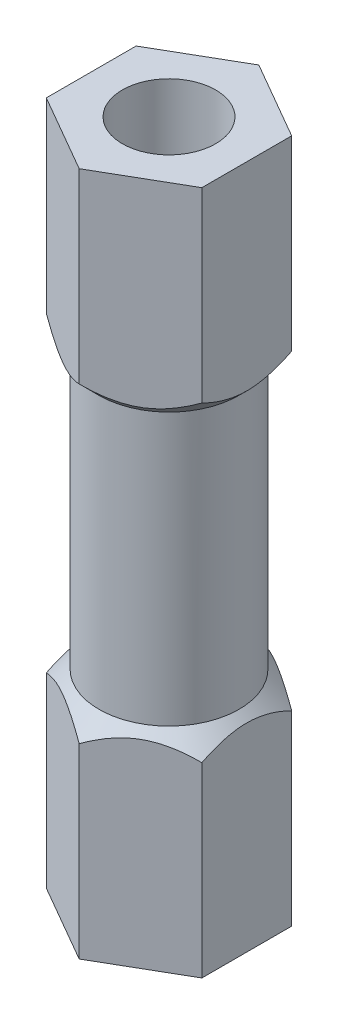
ISO-10303-21;
HEADER;
FILE_DESCRIPTION(('STEP AP214'),'2;1');
FILE_NAME('part.step','',(''),(''),'','','');
FILE_SCHEMA(('AUTOMOTIVE_DESIGN { 1 0 10303 214 1 1 1 1 }'));
ENDSEC;
DATA;
#1=APPLICATION_CONTEXT('core data for automotive mechanical design processes');
#2=APPLICATION_PROTOCOL_DEFINITION('international standard','automotive_design',2000,#1);
#3=PRODUCT_CONTEXT('',#1,'mechanical');
#4=PRODUCT('Part','Part','',(#3));
#5=PRODUCT_RELATED_PRODUCT_CATEGORY('part','',(#4));
#6=PRODUCT_DEFINITION_FORMATION('','',#4);
#7=PRODUCT_DEFINITION_CONTEXT('part definition',#1,'design');
#8=PRODUCT_DEFINITION('design','',#6,#7);
#9=PRODUCT_DEFINITION_SHAPE('','',#8);
#10=(LENGTH_UNIT() NAMED_UNIT(*) SI_UNIT(.MILLI.,.METRE.));
#11=(NAMED_UNIT(*) PLANE_ANGLE_UNIT() SI_UNIT($,.RADIAN.));
#12=(NAMED_UNIT(*) SI_UNIT($,.STERADIAN.) SOLID_ANGLE_UNIT());
#13=UNCERTAINTY_MEASURE_WITH_UNIT(LENGTH_MEASURE(1.E-05),#10,'distance_accuracy_value','');
#14=(GEOMETRIC_REPRESENTATION_CONTEXT(3) GLOBAL_UNCERTAINTY_ASSIGNED_CONTEXT((#13)) GLOBAL_UNIT_ASSIGNED_CONTEXT((#10,
#11,#12)) REPRESENTATION_CONTEXT('',''));
#15=CARTESIAN_POINT('',(0.,0.,0.));
#16=DIRECTION('',(0.,0.,1.));
#17=DIRECTION('',(1.,0.,0.));
#18=AXIS2_PLACEMENT_3D('',#15,#16,#17);
#19=CARTESIAN_POINT('',(0.,11.,0.));
#20=DIRECTION('',(0.,1.,0.));
#21=DIRECTION('',(0.,0.,1.));
#22=AXIS2_PLACEMENT_3D('',#19,#20,#21);
#23=PLANE('',#22);
#24=DIRECTION('',(0.866025403784439,0.,0.5));
#25=VECTOR('',#24,1.);
#26=CARTESIAN_POINT('',(-2.5,11.,1.44337567297406));
#27=LINE('',#26,#25);
#28=CARTESIAN_POINT('',(-2.5,11.,1.44337567297406));
#29=VERTEX_POINT('',#28);
#30=CARTESIAN_POINT('',(0.,11.,2.88675134594813));
#31=VERTEX_POINT('',#30);
#32=EDGE_CURVE('E9',#29,#31,#27,.T.);
#33=ORIENTED_EDGE('',*,*,#32,.T.);
#34=DIRECTION('',(0.866025403784439,0.,-0.5));
#35=VECTOR('',#34,1.);
#36=CARTESIAN_POINT('',(0.,11.,2.88675134594813));
#37=LINE('',#36,#35);
#38=CARTESIAN_POINT('',(2.5,11.,1.44337567297406));
#39=VERTEX_POINT('',#38);
#40=EDGE_CURVE('E470',#31,#39,#37,.T.);
#41=ORIENTED_EDGE('',*,*,#40,.T.);
#42=DIRECTION('',(0.,0.,-1.));
#43=VECTOR('',#42,1.);
#44=CARTESIAN_POINT('',(2.5,11.,1.44337567297406));
#45=LINE('',#44,#43);
#46=CARTESIAN_POINT('',(2.5,11.,-1.44337567297406));
#47=VERTEX_POINT('',#46);
#48=EDGE_CURVE('E344',#39,#47,#45,.T.);
#49=ORIENTED_EDGE('',*,*,#48,.T.);
#50=DIRECTION('',(-0.866025403784439,0.,-0.5));
#51=VECTOR('',#50,1.);
#52=CARTESIAN_POINT('',(2.5,11.,-1.44337567297406));
#53=LINE('',#52,#51);
#54=CARTESIAN_POINT('',(0.,11.,-2.88675134594813));
#55=VERTEX_POINT('',#54);
#56=EDGE_CURVE('E490',#47,#55,#53,.T.);
#57=ORIENTED_EDGE('',*,*,#56,.T.);
#58=DIRECTION('',(-0.866025403784438,0.,0.5));
#59=VECTOR('',#58,1.);
#60=CARTESIAN_POINT('',(0.,11.,-2.88675134594813));
#61=LINE('',#60,#59);
#62=CARTESIAN_POINT('',(-2.5,11.,-1.44337567297406));
#63=VERTEX_POINT('',#62);
#64=EDGE_CURVE('E248',#55,#63,#61,.T.);
#65=ORIENTED_EDGE('',*,*,#64,.T.);
#66=DIRECTION('',(0.,0.,1.));
#67=VECTOR('',#66,1.);
#68=CARTESIAN_POINT('',(-2.5,11.,-1.44337567297406));
#69=LINE('',#68,#67);
#70=EDGE_CURVE('E324',#63,#29,#69,.T.);
#71=ORIENTED_EDGE('',*,*,#70,.T.);
#72=EDGE_LOOP('',(#33,#41,#49,#57,#65,#71));
#73=FACE_BOUND('',#72,.T.);
#74=CARTESIAN_POINT('',(0.,11.,0.));
#75=DIRECTION('',(0.,-1.,0.));
#76=DIRECTION('',(1.,0.,0.));
#77=AXIS2_PLACEMENT_3D('',#74,#75,#76);
#78=CIRCLE('',#77,1.5);
#79=CARTESIAN_POINT('',(1.5,11.,0.));
#80=VERTEX_POINT('',#79);
#81=EDGE_CURVE('E323',#80,#80,#78,.T.);
#82=ORIENTED_EDGE('',*,*,#81,.T.);
#83=EDGE_LOOP('',(#82));
#84=FACE_BOUND('',#83,.T.);
#85=ADVANCED_FACE('F14',(#73,#84),#23,.T.);
#86=CARTESIAN_POINT('',(-2.5,5.,1.44337567297406));
#87=DIRECTION('',(-0.5,0.,0.866025403784439));
#88=DIRECTION('',(0.866025403784439,0.,0.5));
#89=AXIS2_PLACEMENT_3D('',#86,#87,#88);
#90=PLANE('',#89);
#91=DIRECTION('',(0.866025403784439,0.,0.5));
#92=VECTOR('',#91,1.);
#93=CARTESIAN_POINT('',(-2.5,5.,1.44337567297406));
#94=LINE('',#93,#92);
#95=CARTESIAN_POINT('',(-2.5,5.,1.44337567297406));
#96=VERTEX_POINT('',#95);
#97=CARTESIAN_POINT('',(-2.48826491511308,5.,1.45015092739249));
#98=VERTEX_POINT('',#97);
#99=EDGE_CURVE('E385',#96,#98,#94,.T.);
#100=ORIENTED_EDGE('',*,*,#99,.T.);
#101=CARTESIAN_POINT('',(-4.10783134561856,6.26,0.515093812769667));
#102=CARTESIAN_POINT('',(-1.25,3.62966183574879,2.1650635094611));
#103=CARTESIAN_POINT('',(1.60783134561857,6.26,3.81503320615252));
#104=(BOUNDED_CURVE() B_SPLINE_CURVE(2,(#101,#102,#103),.UNSPECIFIED.,.F.,
.F.) B_SPLINE_CURVE_WITH_KNOTS((3,3),(-0.736999321573637,0.),
.UNSPECIFIED.) CURVE() GEOMETRIC_REPRESENTATION_ITEM() RATIONAL_B_SPLINE_CURVE((1.,1.656,1.)) REPRESENTATION_ITEM(''));
#105=CARTESIAN_POINT('',(-0.0117350848869151,5.,2.8799760915297));
#106=VERTEX_POINT('',#105);
#107=EDGE_CURVE('E418',#98,#106,#104,.T.);
#108=ORIENTED_EDGE('',*,*,#107,.T.);
#109=DIRECTION('',(0.866025403784439,0.,0.5));
#110=VECTOR('',#109,1.);
#111=CARTESIAN_POINT('',(-2.5,5.,1.44337567297406));
#112=LINE('',#111,#110);
#113=CARTESIAN_POINT('',(0.,5.,2.88675134594813));
#114=VERTEX_POINT('',#113);
#115=EDGE_CURVE('E399',#106,#114,#112,.T.);
#116=ORIENTED_EDGE('',*,*,#115,.T.);
#117=DIRECTION('',(0.,1.,0.));
#118=VECTOR('',#117,1.);
#119=CARTESIAN_POINT('',(0.,5.,2.88675134594813));
#120=LINE('',#119,#118);
#121=EDGE_CURVE('E27',#114,#31,#120,.T.);
#122=ORIENTED_EDGE('',*,*,#121,.T.);
#123=ORIENTED_EDGE('',*,*,#32,.F.);
#124=DIRECTION('',(0.,1.,0.));
#125=VECTOR('',#124,1.);
#126=CARTESIAN_POINT('',(-2.5,5.,1.44337567297406));
#127=LINE('',#126,#125);
#128=EDGE_CURVE('E327',#96,#29,#127,.T.);
#129=ORIENTED_EDGE('',*,*,#128,.F.);
#130=EDGE_LOOP('',(#100,#108,#116,#122,#123,#129));
#131=FACE_BOUND('',#130,.T.);
#132=ADVANCED_FACE('F551',(#131),#90,.T.);
#133=CARTESIAN_POINT('',(0.,5.,2.88675134594813));
#134=DIRECTION('',(0.5,0.,0.866025403784439));
#135=DIRECTION('',(0.866025403784439,0.,-0.5));
#136=AXIS2_PLACEMENT_3D('',#133,#134,#135);
#137=PLANE('',#136);
#138=DIRECTION('',(0.866025403784439,0.,-0.5));
#139=VECTOR('',#138,1.);
#140=CARTESIAN_POINT('',(0.,5.,2.88675134594813));
#141=LINE('',#140,#139);
#142=CARTESIAN_POINT('',(0.011735084886926,5.,2.8799760915297));
#143=VERTEX_POINT('',#142);
#144=EDGE_CURVE('E381',#114,#143,#141,.T.);
#145=ORIENTED_EDGE('',*,*,#144,.T.);
#146=CARTESIAN_POINT('',(-1.60783134561856,6.26,3.81503320615252));
#147=CARTESIAN_POINT('',(1.25,3.62966183574879,2.16506350946109));
#148=CARTESIAN_POINT('',(4.10783134561856,6.26,0.51509381276967));
#149=(BOUNDED_CURVE() B_SPLINE_CURVE(2,(#146,#147,#148),.UNSPECIFIED.,.F.,
.F.) B_SPLINE_CURVE_WITH_KNOTS((3,3),(-0.736999321573636,0.),
.UNSPECIFIED.) CURVE() GEOMETRIC_REPRESENTATION_ITEM() RATIONAL_B_SPLINE_CURVE((1.,1.656,1.)) REPRESENTATION_ITEM(''));
#150=CARTESIAN_POINT('',(2.48826491511308,5.,1.45015092739249));
#151=VERTEX_POINT('',#150);
#152=EDGE_CURVE('E356',#143,#151,#149,.T.);
#153=ORIENTED_EDGE('',*,*,#152,.T.);
#154=DIRECTION('',(0.866025403784439,0.,-0.5));
#155=VECTOR('',#154,1.);
#156=CARTESIAN_POINT('',(0.,5.,2.88675134594813));
#157=LINE('',#156,#155);
#158=CARTESIAN_POINT('',(2.5,5.,1.44337567297406));
#159=VERTEX_POINT('',#158);
#160=EDGE_CURVE('E349',#151,#159,#157,.T.);
#161=ORIENTED_EDGE('',*,*,#160,.T.);
#162=DIRECTION('',(0.,1.,0.));
#163=VECTOR('',#162,1.);
#164=CARTESIAN_POINT('',(2.5,5.,1.44337567297406));
#165=LINE('',#164,#163);
#166=EDGE_CURVE('E347',#159,#39,#165,.T.);
#167=ORIENTED_EDGE('',*,*,#166,.T.);
#168=ORIENTED_EDGE('',*,*,#40,.F.);
#169=ORIENTED_EDGE('',*,*,#121,.F.);
#170=EDGE_LOOP('',(#145,#153,#161,#167,#168,#169));
#171=FACE_BOUND('',#170,.T.);
#172=ADVANCED_FACE('F562',(#171),#137,.T.);
#173=CARTESIAN_POINT('',(2.5,5.,1.44337567297406));
#174=DIRECTION('',(1.,0.,0.));
#175=DIRECTION('',(0.,0.,-1.));
#176=AXIS2_PLACEMENT_3D('',#173,#174,#175);
#177=PLANE('',#176);
#178=DIRECTION('',(0.,0.,-1.));
#179=VECTOR('',#178,1.);
#180=CARTESIAN_POINT('',(2.5,5.,1.44337567297406));
#181=LINE('',#180,#179);
#182=CARTESIAN_POINT('',(2.5,5.,1.4298251641372));
#183=VERTEX_POINT('',#182);
#184=EDGE_CURVE('E80',#159,#183,#181,.T.);
#185=ORIENTED_EDGE('',*,*,#184,.T.);
#186=CARTESIAN_POINT('',(2.5,6.26,3.29993939338286));
#187=CARTESIAN_POINT('',(2.5,3.62966183574879,0.));
#188=CARTESIAN_POINT('',(2.5,6.26,-3.29993939338286));
#189=(BOUNDED_CURVE() B_SPLINE_CURVE(2,(#186,#187,#188),.UNSPECIFIED.,.F.,
.F.) B_SPLINE_CURVE_WITH_KNOTS((3,3),(-0.736999321573636,0.),
.UNSPECIFIED.) CURVE() GEOMETRIC_REPRESENTATION_ITEM() RATIONAL_B_SPLINE_CURVE((1.,1.656,1.)) REPRESENTATION_ITEM(''));
#190=CARTESIAN_POINT('',(2.5,5.,-1.4298251641372));
#191=VERTEX_POINT('',#190);
#192=EDGE_CURVE('E274',#183,#191,#189,.T.);
#193=ORIENTED_EDGE('',*,*,#192,.T.);
#194=DIRECTION('',(0.,0.,-1.));
#195=VECTOR('',#194,1.);
#196=CARTESIAN_POINT('',(2.5,5.,1.44337567297406));
#197=LINE('',#196,#195);
#198=CARTESIAN_POINT('',(2.5,5.,-1.44337567297406));
#199=VERTEX_POINT('',#198);
#200=EDGE_CURVE('E89',#191,#199,#197,.T.);
#201=ORIENTED_EDGE('',*,*,#200,.T.);
#202=DIRECTION('',(0.,1.,0.));
#203=VECTOR('',#202,1.);
#204=CARTESIAN_POINT('',(2.5,5.,-1.44337567297406));
#205=LINE('',#204,#203);
#206=EDGE_CURVE('E348',#199,#47,#205,.T.);
#207=ORIENTED_EDGE('',*,*,#206,.T.);
#208=ORIENTED_EDGE('',*,*,#48,.F.);
#209=ORIENTED_EDGE('',*,*,#166,.F.);
#210=EDGE_LOOP('',(#185,#193,#201,#207,#208,#209));
#211=FACE_BOUND('',#210,.T.);
#212=ADVANCED_FACE('F555',(#211),#177,.T.);
#213=CARTESIAN_POINT('',(2.5,5.,-1.44337567297406));
#214=DIRECTION('',(0.5,0.,-0.866025403784439));
#215=DIRECTION('',(-0.866025403784439,0.,-0.5));
#216=AXIS2_PLACEMENT_3D('',#213,#214,#215);
#217=PLANE('',#216);
#218=DIRECTION('',(-0.866025403784439,0.,-0.5));
#219=VECTOR('',#218,1.);
#220=CARTESIAN_POINT('',(2.5,5.,-1.44337567297406));
#221=LINE('',#220,#219);
#222=CARTESIAN_POINT('',(2.48826491511307,5.,-1.4501509273925));
#223=VERTEX_POINT('',#222);
#224=EDGE_CURVE('E372',#199,#223,#221,.T.);
#225=ORIENTED_EDGE('',*,*,#224,.T.);
#226=CARTESIAN_POINT('',(4.10783134561856,6.26,-0.515093812769673));
#227=CARTESIAN_POINT('',(1.25,3.62966183574879,-2.1650635094611));
#228=CARTESIAN_POINT('',(-1.60783134561857,6.26,-3.81503320615252));
#229=(BOUNDED_CURVE() B_SPLINE_CURVE(2,(#226,#227,#228),.UNSPECIFIED.,.F.,
.F.) B_SPLINE_CURVE_WITH_KNOTS((3,3),(-0.736999321573636,0.),
.UNSPECIFIED.) CURVE() GEOMETRIC_REPRESENTATION_ITEM() RATIONAL_B_SPLINE_CURVE((1.,1.656,1.)) REPRESENTATION_ITEM(''));
#230=CARTESIAN_POINT('',(0.0117350848869233,5.,-2.8799760915297));
#231=VERTEX_POINT('',#230);
#232=EDGE_CURVE('E266',#223,#231,#229,.T.);
#233=ORIENTED_EDGE('',*,*,#232,.T.);
#234=DIRECTION('',(-0.866025403784439,0.,-0.5));
#235=VECTOR('',#234,1.);
#236=CARTESIAN_POINT('',(2.5,5.,-1.44337567297406));
#237=LINE('',#236,#235);
#238=CARTESIAN_POINT('',(0.,5.,-2.88675134594813));
#239=VERTEX_POINT('',#238);
#240=EDGE_CURVE('E239',#231,#239,#237,.T.);
#241=ORIENTED_EDGE('',*,*,#240,.T.);
#242=DIRECTION('',(0.,1.,0.));
#243=VECTOR('',#242,1.);
#244=CARTESIAN_POINT('',(0.,5.,-2.88675134594813));
#245=LINE('',#244,#243);
#246=EDGE_CURVE('E254',#239,#55,#245,.T.);
#247=ORIENTED_EDGE('',*,*,#246,.T.);
#248=ORIENTED_EDGE('',*,*,#56,.F.);
#249=ORIENTED_EDGE('',*,*,#206,.F.);
#250=EDGE_LOOP('',(#225,#233,#241,#247,#248,#249));
#251=FACE_BOUND('',#250,.T.);
#252=ADVANCED_FACE('F447',(#251),#217,.T.);
#253=CARTESIAN_POINT('',(0.,5.,-2.88675134594813));
#254=DIRECTION('',(-0.5,0.,-0.866025403784438));
#255=DIRECTION('',(-0.866025403784438,0.,0.5));
#256=AXIS2_PLACEMENT_3D('',#253,#254,#255);
#257=PLANE('',#256);
#258=DIRECTION('',(-0.866025403784438,0.,0.5));
#259=VECTOR('',#258,1.);
#260=CARTESIAN_POINT('',(0.,5.,-2.88675134594813));
#261=LINE('',#260,#259);
#262=CARTESIAN_POINT('',(-0.0117350848869184,5.,-2.8799760915297));
#263=VERTEX_POINT('',#262);
#264=EDGE_CURVE('E292',#239,#263,#261,.T.);
#265=ORIENTED_EDGE('',*,*,#264,.T.);
#266=CARTESIAN_POINT('',(1.60783134561857,6.26,-3.81503320615252));
#267=CARTESIAN_POINT('',(-1.25,3.62966183574879,-2.1650635094611));
#268=CARTESIAN_POINT('',(-4.10783134561856,6.26,-0.515093812769662));
#269=(BOUNDED_CURVE() B_SPLINE_CURVE(2,(#266,#267,#268),.UNSPECIFIED.,.F.,
.F.) B_SPLINE_CURVE_WITH_KNOTS((3,3),(-0.736999321573637,0.),
.UNSPECIFIED.) CURVE() GEOMETRIC_REPRESENTATION_ITEM() RATIONAL_B_SPLINE_CURVE((1.,1.656,1.)) REPRESENTATION_ITEM(''));
#270=CARTESIAN_POINT('',(-2.48826491511308,5.,-1.45015092739248));
#271=VERTEX_POINT('',#270);
#272=EDGE_CURVE('E241',#263,#271,#269,.T.);
#273=ORIENTED_EDGE('',*,*,#272,.T.);
#274=DIRECTION('',(-0.866025403784438,0.,0.5));
#275=VECTOR('',#274,1.);
#276=CARTESIAN_POINT('',(0.,5.,-2.88675134594813));
#277=LINE('',#276,#275);
#278=CARTESIAN_POINT('',(-2.5,5.,-1.44337567297406));
#279=VERTEX_POINT('',#278);
#280=EDGE_CURVE('E288',#271,#279,#277,.T.);
#281=ORIENTED_EDGE('',*,*,#280,.T.);
#282=DIRECTION('',(0.,1.,0.));
#283=VECTOR('',#282,1.);
#284=CARTESIAN_POINT('',(-2.5,5.,-1.44337567297406));
#285=LINE('',#284,#283);
#286=EDGE_CURVE('E255',#279,#63,#285,.T.);
#287=ORIENTED_EDGE('',*,*,#286,.T.);
#288=ORIENTED_EDGE('',*,*,#64,.F.);
#289=ORIENTED_EDGE('',*,*,#246,.F.);
#290=EDGE_LOOP('',(#265,#273,#281,#287,#288,#289));
#291=FACE_BOUND('',#290,.T.);
#292=ADVANCED_FACE('F461',(#291),#257,.T.);
#293=CARTESIAN_POINT('',(-2.5,5.,-1.44337567297406));
#294=DIRECTION('',(-1.,0.,0.));
#295=DIRECTION('',(0.,0.,1.));
#296=AXIS2_PLACEMENT_3D('',#293,#294,#295);
#297=PLANE('',#296);
#298=DIRECTION('',(0.,0.,1.));
#299=VECTOR('',#298,1.);
#300=CARTESIAN_POINT('',(-2.5,5.,-1.44337567297406));
#301=LINE('',#300,#299);
#302=CARTESIAN_POINT('',(-2.5,5.,-1.42982516413722));
#303=VERTEX_POINT('',#302);
#304=EDGE_CURVE('E293',#279,#303,#301,.T.);
#305=ORIENTED_EDGE('',*,*,#304,.T.);
#306=CARTESIAN_POINT('',(-2.5,6.26,-3.29993939338286));
#307=CARTESIAN_POINT('',(-2.5,3.62966183574879,0.));
#308=CARTESIAN_POINT('',(-2.5,6.26,3.29993939338287));
#309=(BOUNDED_CURVE() B_SPLINE_CURVE(2,(#306,#307,#308),.UNSPECIFIED.,.F.,
.F.) B_SPLINE_CURVE_WITH_KNOTS((3,3),(-0.736999321573638,0.),
.UNSPECIFIED.) CURVE() GEOMETRIC_REPRESENTATION_ITEM() RATIONAL_B_SPLINE_CURVE((1.,1.656,1.)) REPRESENTATION_ITEM(''));
#310=CARTESIAN_POINT('',(-2.5,5.,1.42982516413722));
#311=VERTEX_POINT('',#310);
#312=EDGE_CURVE('E417',#303,#311,#309,.T.);
#313=ORIENTED_EDGE('',*,*,#312,.T.);
#314=DIRECTION('',(0.,0.,1.));
#315=VECTOR('',#314,1.);
#316=CARTESIAN_POINT('',(-2.5,5.,-1.44337567297406));
#317=LINE('',#316,#315);
#318=EDGE_CURVE('E374',#311,#96,#317,.T.);
#319=ORIENTED_EDGE('',*,*,#318,.T.);
#320=ORIENTED_EDGE('',*,*,#128,.T.);
#321=ORIENTED_EDGE('',*,*,#70,.F.);
#322=ORIENTED_EDGE('',*,*,#286,.F.);
#323=EDGE_LOOP('',(#305,#313,#319,#320,#321,#322));
#324=FACE_BOUND('',#323,.T.);
#325=ADVANCED_FACE('F546',(#324),#297,.T.);
#326=CARTESIAN_POINT('',(0.,5.,0.));
#327=DIRECTION('',(0.,1.,0.));
#328=DIRECTION('',(0.,0.,1.));
#329=AXIS2_PLACEMENT_3D('',#326,#327,#328);
#330=PLANE('',#329);
#331=CARTESIAN_POINT('',(0.,5.,0.));
#332=DIRECTION('',(0.,-1.,0.));
#333=DIRECTION('',(1.,0.,0.));
#334=AXIS2_PLACEMENT_3D('',#331,#332,#333);
#335=CIRCLE('',#334,2.88);
#336=EDGE_CURVE('E278',#183,#151,#335,.T.);
#337=ORIENTED_EDGE('',*,*,#336,.F.);
#338=ORIENTED_EDGE('',*,*,#184,.F.);
#339=ORIENTED_EDGE('',*,*,#160,.F.);
#340=EDGE_LOOP('',(#337,#338,#339));
#341=FACE_BOUND('',#340,.T.);
#342=ADVANCED_FACE('F560',(#341),#330,.F.);
#343=CARTESIAN_POINT('',(0.,-11.,0.));
#344=DIRECTION('',(0.,-1.,0.));
#345=DIRECTION('',(0.,0.,-1.));
#346=AXIS2_PLACEMENT_3D('',#343,#344,#345);
#347=PLANE('',#346);
#348=DIRECTION('',(0.866025403784438,0.,-0.5));
#349=VECTOR('',#348,1.);
#350=CARTESIAN_POINT('',(-2.5,-11.,-1.44337567297406));
#351=LINE('',#350,#349);
#352=CARTESIAN_POINT('',(-2.5,-11.,-1.44337567297406));
#353=VERTEX_POINT('',#352);
#354=CARTESIAN_POINT('',(0.,-11.,-2.88675134594813));
#355=VERTEX_POINT('',#354);
#356=EDGE_CURVE('E436',#353,#355,#351,.T.);
#357=ORIENTED_EDGE('',*,*,#356,.T.);
#358=DIRECTION('',(0.866025403784439,0.,0.5));
#359=VECTOR('',#358,1.);
#360=CARTESIAN_POINT('',(0.,-11.,-2.88675134594813));
#361=LINE('',#360,#359);
#362=CARTESIAN_POINT('',(2.5,-11.,-1.44337567297406));
#363=VERTEX_POINT('',#362);
#364=EDGE_CURVE('E317',#355,#363,#361,.T.);
#365=ORIENTED_EDGE('',*,*,#364,.T.);
#366=DIRECTION('',(0.,0.,1.));
#367=VECTOR('',#366,1.);
#368=CARTESIAN_POINT('',(2.5,-11.,-1.44337567297406));
#369=LINE('',#368,#367);
#370=CARTESIAN_POINT('',(2.5,-11.,1.44337567297406));
#371=VERTEX_POINT('',#370);
#372=EDGE_CURVE('E318',#363,#371,#369,.T.);
#373=ORIENTED_EDGE('',*,*,#372,.T.);
#374=DIRECTION('',(-0.866025403784439,0.,0.5));
#375=VECTOR('',#374,1.);
#376=CARTESIAN_POINT('',(2.5,-11.,1.44337567297406));
#377=LINE('',#376,#375);
#378=CARTESIAN_POINT('',(0.,-11.,2.88675134594813));
#379=VERTEX_POINT('',#378);
#380=EDGE_CURVE('E343',#371,#379,#377,.T.);
#381=ORIENTED_EDGE('',*,*,#380,.T.);
#382=DIRECTION('',(-0.866025403784439,0.,-0.5));
#383=VECTOR('',#382,1.);
#384=CARTESIAN_POINT('',(0.,-11.,2.88675134594813));
#385=LINE('',#384,#383);
#386=CARTESIAN_POINT('',(-2.5,-11.,1.44337567297406));
#387=VERTEX_POINT('',#386);
#388=EDGE_CURVE('E211',#379,#387,#385,.T.);
#389=ORIENTED_EDGE('',*,*,#388,.T.);
#390=DIRECTION('',(0.,0.,-1.));
#391=VECTOR('',#390,1.);
#392=CARTESIAN_POINT('',(-2.5,-11.,1.44337567297406));
#393=LINE('',#392,#391);
#394=EDGE_CURVE('E209',#387,#353,#393,.T.);
#395=ORIENTED_EDGE('',*,*,#394,.T.);
#396=EDGE_LOOP('',(#357,#365,#373,#381,#389,#395));
#397=FACE_BOUND('',#396,.T.);
#398=CARTESIAN_POINT('',(0.,-11.,0.));
#399=DIRECTION('',(0.,1.,0.));
#400=DIRECTION('',(1.,0.,0.));
#401=AXIS2_PLACEMENT_3D('',#398,#399,#400);
#402=CIRCLE('',#401,1.5);
#403=CARTESIAN_POINT('',(-1.5,-11.,0.));
#404=VERTEX_POINT('',#403);
#405=EDGE_CURVE('E321',#404,#404,#402,.T.);
#406=ORIENTED_EDGE('',*,*,#405,.T.);
#407=EDGE_LOOP('',(#406));
#408=FACE_BOUND('',#407,.T.);
#409=ADVANCED_FACE('F623',(#397,#408),#347,.T.);
#410=CARTESIAN_POINT('',(-2.5,-5.,-1.44337567297406));
#411=DIRECTION('',(-0.5,0.,-0.866025403784438));
#412=DIRECTION('',(0.866025403784438,0.,-0.5));
#413=AXIS2_PLACEMENT_3D('',#410,#411,#412);
#414=PLANE('',#413);
#415=DIRECTION('',(0.866025403784438,0.,-0.5));
#416=VECTOR('',#415,1.);
#417=CARTESIAN_POINT('',(-2.5,-5.,-1.44337567297406));
#418=LINE('',#417,#416);
#419=CARTESIAN_POINT('',(-2.5,-5.,-1.44337567297406));
#420=VERTEX_POINT('',#419);
#421=CARTESIAN_POINT('',(-2.48826491511308,-5.,-1.45015092739248));
#422=VERTEX_POINT('',#421);
#423=EDGE_CURVE('E280',#420,#422,#418,.T.);
#424=ORIENTED_EDGE('',*,*,#423,.T.);
#425=CARTESIAN_POINT('',(-4.10783134561856,-6.26,-0.515093812769662));
#426=CARTESIAN_POINT('',(-1.25,-3.62966183574879,-2.1650635094611));
#427=CARTESIAN_POINT('',(1.60783134561857,-6.26,-3.81503320615252));
#428=(BOUNDED_CURVE() B_SPLINE_CURVE(2,(#425,#426,#427),.UNSPECIFIED.,.F.,
.F.) B_SPLINE_CURVE_WITH_KNOTS((3,3),(-0.736999321573637,0.),
.UNSPECIFIED.) CURVE() GEOMETRIC_REPRESENTATION_ITEM() RATIONAL_B_SPLINE_CURVE((1.,1.656,1.)) REPRESENTATION_ITEM(''));
#429=CARTESIAN_POINT('',(-0.0117350848869184,-5.,-2.8799760915297));
#430=VERTEX_POINT('',#429);
#431=EDGE_CURVE('E331',#422,#430,#428,.T.);
#432=ORIENTED_EDGE('',*,*,#431,.T.);
#433=DIRECTION('',(0.866025403784438,0.,-0.5));
#434=VECTOR('',#433,1.);
#435=CARTESIAN_POINT('',(-2.5,-5.,-1.44337567297406));
#436=LINE('',#435,#434);
#437=CARTESIAN_POINT('',(0.,-5.,-2.88675134594813));
#438=VERTEX_POINT('',#437);
#439=EDGE_CURVE('E312',#430,#438,#436,.T.);
#440=ORIENTED_EDGE('',*,*,#439,.T.);
#441=DIRECTION('',(0.,-1.,0.));
#442=VECTOR('',#441,1.);
#443=CARTESIAN_POINT('',(0.,-5.,-2.88675134594813));
#444=LINE('',#443,#442);
#445=EDGE_CURVE('E432',#438,#355,#444,.T.);
#446=ORIENTED_EDGE('',*,*,#445,.T.);
#447=ORIENTED_EDGE('',*,*,#356,.F.);
#448=DIRECTION('',(0.,-1.,0.));
#449=VECTOR('',#448,1.);
#450=CARTESIAN_POINT('',(-2.5,-5.,-1.44337567297406));
#451=LINE('',#450,#449);
#452=EDGE_CURVE('E302',#420,#353,#451,.T.);
#453=ORIENTED_EDGE('',*,*,#452,.F.);
#454=EDGE_LOOP('',(#424,#432,#440,#446,#447,#453));
#455=FACE_BOUND('',#454,.T.);
#456=ADVANCED_FACE('F16',(#455),#414,.T.);
#457=CARTESIAN_POINT('',(0.,-5.,-2.88675134594813));
#458=DIRECTION('',(0.5,0.,-0.866025403784439));
#459=DIRECTION('',(0.866025403784439,0.,0.5));
#460=AXIS2_PLACEMENT_3D('',#457,#458,#459);
#461=PLANE('',#460);
#462=DIRECTION('',(0.866025403784439,0.,0.5));
#463=VECTOR('',#462,1.);
#464=CARTESIAN_POINT('',(0.,-5.,-2.88675134594813));
#465=LINE('',#464,#463);
#466=CARTESIAN_POINT('',(0.011735084886923,-5.,-2.8799760915297));
#467=VERTEX_POINT('',#466);
#468=EDGE_CURVE('E309',#438,#467,#465,.T.);
#469=ORIENTED_EDGE('',*,*,#468,.T.);
#470=CARTESIAN_POINT('',(-1.60783134561857,-6.26,-3.81503320615252));
#471=CARTESIAN_POINT('',(1.25,-3.62966183574879,-2.1650635094611));
#472=CARTESIAN_POINT('',(4.10783134561856,-6.26,-0.515093812769674));
#473=(BOUNDED_CURVE() B_SPLINE_CURVE(2,(#470,#471,#472),.UNSPECIFIED.,.F.,
.F.) B_SPLINE_CURVE_WITH_KNOTS((3,3),(-0.736999321573637,0.),
.UNSPECIFIED.) CURVE() GEOMETRIC_REPRESENTATION_ITEM() RATIONAL_B_SPLINE_CURVE((1.,1.656,1.)) REPRESENTATION_ITEM(''));
#474=CARTESIAN_POINT('',(2.48826491511307,-5.,-1.4501509273925));
#475=VERTEX_POINT('',#474);
#476=EDGE_CURVE('E235',#467,#475,#473,.T.);
#477=ORIENTED_EDGE('',*,*,#476,.T.);
#478=DIRECTION('',(0.866025403784439,0.,0.5));
#479=VECTOR('',#478,1.);
#480=CARTESIAN_POINT('',(0.,-5.,-2.88675134594813));
#481=LINE('',#480,#479);
#482=CARTESIAN_POINT('',(2.5,-5.,-1.44337567297406));
#483=VERTEX_POINT('',#482);
#484=EDGE_CURVE('E298',#475,#483,#481,.T.);
#485=ORIENTED_EDGE('',*,*,#484,.T.);
#486=DIRECTION('',(0.,-1.,0.));
#487=VECTOR('',#486,1.);
#488=CARTESIAN_POINT('',(2.5,-5.,-1.44337567297406));
#489=LINE('',#488,#487);
#490=EDGE_CURVE('E313',#483,#363,#489,.T.);
#491=ORIENTED_EDGE('',*,*,#490,.T.);
#492=ORIENTED_EDGE('',*,*,#364,.F.);
#493=ORIENTED_EDGE('',*,*,#445,.F.);
#494=EDGE_LOOP('',(#469,#477,#485,#491,#492,#493));
#495=FACE_BOUND('',#494,.T.);
#496=ADVANCED_FACE('F640',(#495),#461,.T.);
#497=CARTESIAN_POINT('',(2.5,-5.,-1.44337567297406));
#498=DIRECTION('',(1.,0.,0.));
#499=DIRECTION('',(0.,0.,1.));
#500=AXIS2_PLACEMENT_3D('',#497,#498,#499);
#501=PLANE('',#500);
#502=DIRECTION('',(0.,0.,1.));
#503=VECTOR('',#502,1.);
#504=CARTESIAN_POINT('',(2.5,-5.,-1.44337567297406));
#505=LINE('',#504,#503);
#506=CARTESIAN_POINT('',(2.5,-5.,-1.4298251641372));
#507=VERTEX_POINT('',#506);
#508=EDGE_CURVE('E303',#483,#507,#505,.T.);
#509=ORIENTED_EDGE('',*,*,#508,.T.);
#510=CARTESIAN_POINT('',(2.5,-6.26,-3.29993939338286));
#511=CARTESIAN_POINT('',(2.5,-3.62966183574879,0.));
#512=CARTESIAN_POINT('',(2.5,-6.26,3.29993939338286));
#513=(BOUNDED_CURVE() B_SPLINE_CURVE(2,(#510,#511,#512),.UNSPECIFIED.,.F.,
.F.) B_SPLINE_CURVE_WITH_KNOTS((3,3),(-0.736999321573636,0.),
.UNSPECIFIED.) CURVE() GEOMETRIC_REPRESENTATION_ITEM() RATIONAL_B_SPLINE_CURVE((1.,1.656,1.)) REPRESENTATION_ITEM(''));
#514=CARTESIAN_POINT('',(2.5,-5.,1.4298251641372));
#515=VERTEX_POINT('',#514);
#516=EDGE_CURVE('E18',#507,#515,#513,.T.);
#517=ORIENTED_EDGE('',*,*,#516,.T.);
#518=DIRECTION('',(0.,0.,1.));
#519=VECTOR('',#518,1.);
#520=CARTESIAN_POINT('',(2.5,-5.,-1.44337567297406));
#521=LINE('',#520,#519);
#522=CARTESIAN_POINT('',(2.5,-5.,1.44337567297406));
#523=VERTEX_POINT('',#522);
#524=EDGE_CURVE('E104',#515,#523,#521,.T.);
#525=ORIENTED_EDGE('',*,*,#524,.T.);
#526=DIRECTION('',(0.,-1.,0.));
#527=VECTOR('',#526,1.);
#528=CARTESIAN_POINT('',(2.5,-5.,1.44337567297406));
#529=LINE('',#528,#527);
#530=EDGE_CURVE('E362',#523,#371,#529,.T.);
#531=ORIENTED_EDGE('',*,*,#530,.T.);
#532=ORIENTED_EDGE('',*,*,#372,.F.);
#533=ORIENTED_EDGE('',*,*,#490,.F.);
#534=EDGE_LOOP('',(#509,#517,#525,#531,#532,#533));
#535=FACE_BOUND('',#534,.T.);
#536=ADVANCED_FACE('F626',(#535),#501,.T.);
#537=CARTESIAN_POINT('',(2.5,-5.,1.44337567297406));
#538=DIRECTION('',(0.5,0.,0.866025403784439));
#539=DIRECTION('',(-0.866025403784439,0.,0.5));
#540=AXIS2_PLACEMENT_3D('',#537,#538,#539);
#541=PLANE('',#540);
#542=DIRECTION('',(-0.866025403784439,0.,0.5));
#543=VECTOR('',#542,1.);
#544=CARTESIAN_POINT('',(2.5,-5.,1.44337567297406));
#545=LINE('',#544,#543);
#546=CARTESIAN_POINT('',(2.48826491511307,-5.,1.4501509273925));
#547=VERTEX_POINT('',#546);
#548=EDGE_CURVE('E115',#523,#547,#545,.T.);
#549=ORIENTED_EDGE('',*,*,#548,.T.);
#550=CARTESIAN_POINT('',(4.10783134561856,-6.26,0.515093812769671));
#551=CARTESIAN_POINT('',(1.25,-3.62966183574879,2.1650635094611));
#552=CARTESIAN_POINT('',(-1.60783134561856,-6.26,3.81503320615252));
#553=(BOUNDED_CURVE() B_SPLINE_CURVE(2,(#550,#551,#552),.UNSPECIFIED.,.F.,
.F.) B_SPLINE_CURVE_WITH_KNOTS((3,3),(-0.736999321573636,0.),
.UNSPECIFIED.) CURVE() GEOMETRIC_REPRESENTATION_ITEM() RATIONAL_B_SPLINE_CURVE((1.,1.656,1.)) REPRESENTATION_ITEM(''));
#554=CARTESIAN_POINT('',(0.0117350848869267,-5.,2.8799760915297));
#555=VERTEX_POINT('',#554);
#556=EDGE_CURVE('E306',#547,#555,#553,.T.);
#557=ORIENTED_EDGE('',*,*,#556,.T.);
#558=DIRECTION('',(-0.866025403784439,0.,0.5));
#559=VECTOR('',#558,1.);
#560=CARTESIAN_POINT('',(2.5,-5.,1.44337567297406));
#561=LINE('',#560,#559);
#562=CARTESIAN_POINT('',(0.,-5.,2.88675134594813));
#563=VERTEX_POINT('',#562);
#564=EDGE_CURVE('E287',#555,#563,#561,.T.);
#565=ORIENTED_EDGE('',*,*,#564,.T.);
#566=DIRECTION('',(0.,-1.,0.));
#567=VECTOR('',#566,1.);
#568=CARTESIAN_POINT('',(0.,-5.,2.88675134594813));
#569=LINE('',#568,#567);
#570=EDGE_CURVE('E194',#563,#379,#569,.T.);
#571=ORIENTED_EDGE('',*,*,#570,.T.);
#572=ORIENTED_EDGE('',*,*,#380,.F.);
#573=ORIENTED_EDGE('',*,*,#530,.F.);
#574=EDGE_LOOP('',(#549,#557,#565,#571,#572,#573));
#575=FACE_BOUND('',#574,.T.);
#576=ADVANCED_FACE('F624',(#575),#541,.T.);
#577=CARTESIAN_POINT('',(0.,-5.,2.88675134594813));
#578=DIRECTION('',(-0.5,0.,0.866025403784439));
#579=DIRECTION('',(-0.866025403784439,0.,-0.5));
#580=AXIS2_PLACEMENT_3D('',#577,#578,#579);
#581=PLANE('',#580);
#582=DIRECTION('',(-0.866025403784439,0.,-0.5));
#583=VECTOR('',#582,1.);
#584=CARTESIAN_POINT('',(0.,-5.,2.88675134594813));
#585=LINE('',#584,#583);
#586=CARTESIAN_POINT('',(-0.0117350848869159,-5.,2.8799760915297));
#587=VERTEX_POINT('',#586);
#588=EDGE_CURVE('E222',#563,#587,#585,.T.);
#589=ORIENTED_EDGE('',*,*,#588,.T.);
#590=CARTESIAN_POINT('',(1.60783134561857,-6.26,3.81503320615252));
#591=CARTESIAN_POINT('',(-1.25,-3.62966183574879,2.16506350946109));
#592=CARTESIAN_POINT('',(-4.10783134561856,-6.26,0.515093812769667));
#593=(BOUNDED_CURVE() B_SPLINE_CURVE(2,(#590,#591,#592),.UNSPECIFIED.,.F.,
.F.) B_SPLINE_CURVE_WITH_KNOTS((3,3),(-0.736999321573638,0.),
.UNSPECIFIED.) CURVE() GEOMETRIC_REPRESENTATION_ITEM() RATIONAL_B_SPLINE_CURVE((1.,1.656,1.)) REPRESENTATION_ITEM(''));
#594=CARTESIAN_POINT('',(-2.48826491511308,-5.,1.45015092739249));
#595=VERTEX_POINT('',#594);
#596=EDGE_CURVE('E218',#587,#595,#593,.T.);
#597=ORIENTED_EDGE('',*,*,#596,.T.);
#598=DIRECTION('',(-0.866025403784439,0.,-0.5));
#599=VECTOR('',#598,1.);
#600=CARTESIAN_POINT('',(0.,-5.,2.88675134594813));
#601=LINE('',#600,#599);
#602=CARTESIAN_POINT('',(-2.5,-5.,1.44337567297406));
#603=VERTEX_POINT('',#602);
#604=EDGE_CURVE('E215',#595,#603,#601,.T.);
#605=ORIENTED_EDGE('',*,*,#604,.T.);
#606=DIRECTION('',(0.,-1.,0.));
#607=VECTOR('',#606,1.);
#608=CARTESIAN_POINT('',(-2.5,-5.,1.44337567297406));
#609=LINE('',#608,#607);
#610=EDGE_CURVE('E200',#603,#387,#609,.T.);
#611=ORIENTED_EDGE('',*,*,#610,.T.);
#612=ORIENTED_EDGE('',*,*,#388,.F.);
#613=ORIENTED_EDGE('',*,*,#570,.F.);
#614=EDGE_LOOP('',(#589,#597,#605,#611,#612,#613));
#615=FACE_BOUND('',#614,.T.);
#616=ADVANCED_FACE('F216',(#615),#581,.T.);
#617=CARTESIAN_POINT('',(-2.5,-5.,1.44337567297406));
#618=DIRECTION('',(-1.,0.,0.));
#619=DIRECTION('',(0.,0.,-1.));
#620=AXIS2_PLACEMENT_3D('',#617,#618,#619);
#621=PLANE('',#620);
#622=DIRECTION('',(0.,0.,-1.));
#623=VECTOR('',#622,1.);
#624=CARTESIAN_POINT('',(-2.5,-5.,1.44337567297406));
#625=LINE('',#624,#623);
#626=CARTESIAN_POINT('',(-2.5,-5.,1.42982516413722));
#627=VERTEX_POINT('',#626);
#628=EDGE_CURVE('E205',#603,#627,#625,.T.);
#629=ORIENTED_EDGE('',*,*,#628,.T.);
#630=CARTESIAN_POINT('',(-2.5,-6.26,3.29993939338287));
#631=CARTESIAN_POINT('',(-2.5,-3.62966183574879,0.));
#632=CARTESIAN_POINT('',(-2.5,-6.26,-3.29993939338286));
#633=(BOUNDED_CURVE() B_SPLINE_CURVE(2,(#630,#631,#632),.UNSPECIFIED.,.F.,
.F.) B_SPLINE_CURVE_WITH_KNOTS((3,3),(-0.736999321573638,0.),
.UNSPECIFIED.) CURVE() GEOMETRIC_REPRESENTATION_ITEM() RATIONAL_B_SPLINE_CURVE((1.,1.656,1.)) REPRESENTATION_ITEM(''));
#634=CARTESIAN_POINT('',(-2.5,-5.,-1.42982516413722));
#635=VERTEX_POINT('',#634);
#636=EDGE_CURVE('E297',#627,#635,#633,.T.);
#637=ORIENTED_EDGE('',*,*,#636,.T.);
#638=DIRECTION('',(0.,0.,-1.));
#639=VECTOR('',#638,1.);
#640=CARTESIAN_POINT('',(-2.5,-5.,1.44337567297406));
#641=LINE('',#640,#639);
#642=EDGE_CURVE('E286',#635,#420,#641,.T.);
#643=ORIENTED_EDGE('',*,*,#642,.T.);
#644=ORIENTED_EDGE('',*,*,#452,.T.);
#645=ORIENTED_EDGE('',*,*,#394,.F.);
#646=ORIENTED_EDGE('',*,*,#610,.F.);
#647=EDGE_LOOP('',(#629,#637,#643,#644,#645,#646));
#648=FACE_BOUND('',#647,.T.);
#649=ADVANCED_FACE('F202',(#648),#621,.T.);
#650=CARTESIAN_POINT('',(0.,-5.,0.));
#651=DIRECTION('',(0.,-1.,0.));
#652=DIRECTION('',(0.,0.,-1.));
#653=AXIS2_PLACEMENT_3D('',#650,#651,#652);
#654=PLANE('',#653);
#655=CARTESIAN_POINT('',(0.,-5.,0.));
#656=DIRECTION('',(0.,1.,0.));
#657=DIRECTION('',(1.,0.,0.));
#658=AXIS2_PLACEMENT_3D('',#655,#656,#657);
#659=CIRCLE('',#658,2.88);
#660=EDGE_CURVE('E260',#507,#475,#659,.T.);
#661=ORIENTED_EDGE('',*,*,#660,.F.);
#662=ORIENTED_EDGE('',*,*,#508,.F.);
#663=ORIENTED_EDGE('',*,*,#484,.F.);
#664=EDGE_LOOP('',(#661,#662,#663));
#665=FACE_BOUND('',#664,.T.);
#666=ADVANCED_FACE('F609',(#665),#654,.F.);
#667=CARTESIAN_POINT('',(0.,-5.,0.));
#668=DIRECTION('',(0.,-1.,0.));
#669=DIRECTION('',(0.,0.,-1.));
#670=AXIS2_PLACEMENT_3D('',#667,#668,#669);
#671=PLANE('',#670);
#672=CARTESIAN_POINT('',(0.,-5.,0.));
#673=DIRECTION('',(0.,1.,0.));
#674=DIRECTION('',(1.,0.,0.));
#675=AXIS2_PLACEMENT_3D('',#672,#673,#674);
#676=CIRCLE('',#675,2.88);
#677=EDGE_CURVE('E228',#467,#430,#676,.T.);
#678=ORIENTED_EDGE('',*,*,#677,.F.);
#679=ORIENTED_EDGE('',*,*,#468,.F.);
#680=ORIENTED_EDGE('',*,*,#439,.F.);
#681=EDGE_LOOP('',(#678,#679,#680));
#682=FACE_BOUND('',#681,.T.);
#683=ADVANCED_FACE('F612',(#682),#671,.F.);
#684=CARTESIAN_POINT('',(0.,-5.,0.));
#685=DIRECTION('',(0.,-1.,0.));
#686=DIRECTION('',(0.,0.,-1.));
#687=AXIS2_PLACEMENT_3D('',#684,#685,#686);
#688=PLANE('',#687);
#689=CARTESIAN_POINT('',(0.,-5.,0.));
#690=DIRECTION('',(0.,1.,0.));
#691=DIRECTION('',(1.,0.,0.));
#692=AXIS2_PLACEMENT_3D('',#689,#690,#691);
#693=CIRCLE('',#692,2.88);
#694=EDGE_CURVE('E328',#547,#515,#693,.T.);
#695=ORIENTED_EDGE('',*,*,#694,.F.);
#696=ORIENTED_EDGE('',*,*,#548,.F.);
#697=ORIENTED_EDGE('',*,*,#524,.F.);
#698=EDGE_LOOP('',(#695,#696,#697));
#699=FACE_BOUND('',#698,.T.);
#700=ADVANCED_FACE('F603',(#699),#688,.F.);
#701=CARTESIAN_POINT('',(0.,-5.,0.));
#702=DIRECTION('',(0.,-1.,0.));
#703=DIRECTION('',(0.,0.,-1.));
#704=AXIS2_PLACEMENT_3D('',#701,#702,#703);
#705=PLANE('',#704);
#706=CARTESIAN_POINT('',(0.,-5.,0.));
#707=DIRECTION('',(0.,1.,0.));
#708=DIRECTION('',(1.,0.,0.));
#709=AXIS2_PLACEMENT_3D('',#706,#707,#708);
#710=CIRCLE('',#709,2.88);
#711=EDGE_CURVE('E336',#422,#635,#710,.T.);
#712=ORIENTED_EDGE('',*,*,#711,.F.);
#713=ORIENTED_EDGE('',*,*,#423,.F.);
#714=ORIENTED_EDGE('',*,*,#642,.F.);
#715=EDGE_LOOP('',(#712,#713,#714));
#716=FACE_BOUND('',#715,.T.);
#717=ADVANCED_FACE('F600',(#716),#705,.F.);
#718=CARTESIAN_POINT('',(0.,-5.,0.));
#719=DIRECTION('',(0.,-1.,0.));
#720=DIRECTION('',(0.,0.,-1.));
#721=AXIS2_PLACEMENT_3D('',#718,#719,#720);
#722=PLANE('',#721);
#723=CARTESIAN_POINT('',(0.,-5.,0.));
#724=DIRECTION('',(0.,1.,0.));
#725=DIRECTION('',(1.,0.,0.));
#726=AXIS2_PLACEMENT_3D('',#723,#724,#725);
#727=CIRCLE('',#726,2.88);
#728=EDGE_CURVE('E269',#587,#555,#727,.T.);
#729=ORIENTED_EDGE('',*,*,#728,.F.);
#730=ORIENTED_EDGE('',*,*,#588,.F.);
#731=ORIENTED_EDGE('',*,*,#564,.F.);
#732=EDGE_LOOP('',(#729,#730,#731));
#733=FACE_BOUND('',#732,.T.);
#734=ADVANCED_FACE('F589',(#733),#722,.F.);
#735=CARTESIAN_POINT('',(0.,-5.,0.));
#736=DIRECTION('',(0.,-1.,0.));
#737=DIRECTION('',(0.,0.,-1.));
#738=AXIS2_PLACEMENT_3D('',#735,#736,#737);
#739=PLANE('',#738);
#740=CARTESIAN_POINT('',(0.,-5.,0.));
#741=DIRECTION('',(0.,1.,0.));
#742=DIRECTION('',(1.,0.,0.));
#743=AXIS2_PLACEMENT_3D('',#740,#741,#742);
#744=CIRCLE('',#743,2.88);
#745=EDGE_CURVE('E225',#627,#595,#744,.T.);
#746=ORIENTED_EDGE('',*,*,#745,.F.);
#747=ORIENTED_EDGE('',*,*,#628,.F.);
#748=ORIENTED_EDGE('',*,*,#604,.F.);
#749=EDGE_LOOP('',(#746,#747,#748));
#750=FACE_BOUND('',#749,.T.);
#751=ADVANCED_FACE('F224',(#750),#739,.F.);
#752=CARTESIAN_POINT('',(0.,-4.685,0.));
#753=DIRECTION('',(0.,-1.,0.));
#754=DIRECTION('',(1.,0.,0.));
#755=AXIS2_PLACEMENT_3D('',#752,#753,#754);
#756=CONICAL_SURFACE('',#755,2.565,0.785398163397449);
#757=ORIENTED_EDGE('',*,*,#431,.F.);
#758=ORIENTED_EDGE('',*,*,#711,.T.);
#759=ORIENTED_EDGE('',*,*,#636,.F.);
#760=ORIENTED_EDGE('',*,*,#745,.T.);
#761=ORIENTED_EDGE('',*,*,#596,.F.);
#762=ORIENTED_EDGE('',*,*,#728,.T.);
#763=ORIENTED_EDGE('',*,*,#556,.F.);
#764=ORIENTED_EDGE('',*,*,#694,.T.);
#765=ORIENTED_EDGE('',*,*,#516,.F.);
#766=ORIENTED_EDGE('',*,*,#660,.T.);
#767=ORIENTED_EDGE('',*,*,#476,.F.);
#768=ORIENTED_EDGE('',*,*,#677,.T.);
#769=EDGE_LOOP('',(#757,#758,#759,#760,#761,#762,#763,#764,#765,#766,#767,#768));
#770=FACE_BOUND('',#769,.T.);
#771=CARTESIAN_POINT('',(0.,-4.37,0.));
#772=DIRECTION('',(0.,-1.,0.));
#773=DIRECTION('',(1.,0.,0.));
#774=AXIS2_PLACEMENT_3D('',#771,#772,#773);
#775=CIRCLE('',#774,2.25);
#776=CARTESIAN_POINT('',(-2.25,-4.37,0.));
#777=VERTEX_POINT('',#776);
#778=EDGE_CURVE('E337',#777,#777,#775,.T.);
#779=ORIENTED_EDGE('',*,*,#778,.T.);
#780=EDGE_LOOP('',(#779));
#781=FACE_BOUND('',#780,.T.);
#782=ADVANCED_FACE('F577',(#770,#781),#756,.T.);
#783=CARTESIAN_POINT('',(0.,0.,0.));
#784=DIRECTION('',(0.,-1.,0.));
#785=DIRECTION('',(-1.,0.,0.));
#786=AXIS2_PLACEMENT_3D('',#783,#784,#785);
#787=CYLINDRICAL_SURFACE('',#786,2.25);
#788=CARTESIAN_POINT('',(0.,4.37,0.));
#789=DIRECTION('',(0.,1.,0.));
#790=DIRECTION('',(1.,0.,0.));
#791=AXIS2_PLACEMENT_3D('',#788,#789,#790);
#792=CIRCLE('',#791,2.25);
#793=CARTESIAN_POINT('',(-2.25,4.37,0.));
#794=VERTEX_POINT('',#793);
#795=EDGE_CURVE('E404',#794,#794,#792,.T.);
#796=ORIENTED_EDGE('',*,*,#795,.F.);
#797=EDGE_LOOP('',(#796));
#798=FACE_BOUND('',#797,.T.);
#799=ORIENTED_EDGE('',*,*,#778,.F.);
#800=EDGE_LOOP('',(#799));
#801=FACE_BOUND('',#800,.T.);
#802=ADVANCED_FACE('F569',(#798,#801),#787,.T.);
#803=CARTESIAN_POINT('',(0.,5.,0.));
#804=DIRECTION('',(0.,1.,0.));
#805=DIRECTION('',(0.,0.,1.));
#806=AXIS2_PLACEMENT_3D('',#803,#804,#805);
#807=PLANE('',#806);
#808=CARTESIAN_POINT('',(0.,5.,0.));
#809=DIRECTION('',(0.,-1.,0.));
#810=DIRECTION('',(1.,0.,0.));
#811=AXIS2_PLACEMENT_3D('',#808,#809,#810);
#812=CIRCLE('',#811,2.88);
#813=EDGE_CURVE('E353',#143,#106,#812,.T.);
#814=ORIENTED_EDGE('',*,*,#813,.F.);
#815=ORIENTED_EDGE('',*,*,#144,.F.);
#816=ORIENTED_EDGE('',*,*,#115,.F.);
#817=EDGE_LOOP('',(#814,#815,#816));
#818=FACE_BOUND('',#817,.T.);
#819=ADVANCED_FACE('F567',(#818),#807,.F.);
#820=CARTESIAN_POINT('',(0.,5.,0.));
#821=DIRECTION('',(0.,1.,0.));
#822=DIRECTION('',(0.,0.,1.));
#823=AXIS2_PLACEMENT_3D('',#820,#821,#822);
#824=PLANE('',#823);
#825=CARTESIAN_POINT('',(0.,5.,0.));
#826=DIRECTION('',(0.,-1.,0.));
#827=DIRECTION('',(1.,0.,0.));
#828=AXIS2_PLACEMENT_3D('',#825,#826,#827);
#829=CIRCLE('',#828,2.88);
#830=EDGE_CURVE('E279',#223,#191,#829,.T.);
#831=ORIENTED_EDGE('',*,*,#830,.F.);
#832=ORIENTED_EDGE('',*,*,#224,.F.);
#833=ORIENTED_EDGE('',*,*,#200,.F.);
#834=EDGE_LOOP('',(#831,#832,#833));
#835=FACE_BOUND('',#834,.T.);
#836=ADVANCED_FACE('F557',(#835),#824,.F.);
#837=CARTESIAN_POINT('',(0.,5.,0.));
#838=DIRECTION('',(0.,1.,0.));
#839=DIRECTION('',(0.,0.,1.));
#840=AXIS2_PLACEMENT_3D('',#837,#838,#839);
#841=PLANE('',#840);
#842=CARTESIAN_POINT('',(0.,5.,0.));
#843=DIRECTION('',(0.,-1.,0.));
#844=DIRECTION('',(1.,0.,0.));
#845=AXIS2_PLACEMENT_3D('',#842,#843,#844);
#846=CIRCLE('',#845,2.88);
#847=EDGE_CURVE('E414',#98,#311,#846,.T.);
#848=ORIENTED_EDGE('',*,*,#847,.F.);
#849=ORIENTED_EDGE('',*,*,#99,.F.);
#850=ORIENTED_EDGE('',*,*,#318,.F.);
#851=EDGE_LOOP('',(#848,#849,#850));
#852=FACE_BOUND('',#851,.T.);
#853=ADVANCED_FACE('F549',(#852),#841,.F.);
#854=CARTESIAN_POINT('',(0.,5.,0.));
#855=DIRECTION('',(0.,1.,0.));
#856=DIRECTION('',(0.,0.,1.));
#857=AXIS2_PLACEMENT_3D('',#854,#855,#856);
#858=PLANE('',#857);
#859=CARTESIAN_POINT('',(0.,5.,0.));
#860=DIRECTION('',(0.,-1.,0.));
#861=DIRECTION('',(1.,0.,0.));
#862=AXIS2_PLACEMENT_3D('',#859,#860,#861);
#863=CIRCLE('',#862,2.88);
#864=EDGE_CURVE('E246',#263,#231,#863,.T.);
#865=ORIENTED_EDGE('',*,*,#864,.F.);
#866=ORIENTED_EDGE('',*,*,#264,.F.);
#867=ORIENTED_EDGE('',*,*,#240,.F.);
#868=EDGE_LOOP('',(#865,#866,#867));
#869=FACE_BOUND('',#868,.T.);
#870=ADVANCED_FACE('F452',(#869),#858,.F.);
#871=CARTESIAN_POINT('',(0.,5.,0.));
#872=DIRECTION('',(0.,1.,0.));
#873=DIRECTION('',(0.,0.,1.));
#874=AXIS2_PLACEMENT_3D('',#871,#872,#873);
#875=PLANE('',#874);
#876=CARTESIAN_POINT('',(0.,5.,0.));
#877=DIRECTION('',(0.,-1.,0.));
#878=DIRECTION('',(1.,0.,0.));
#879=AXIS2_PLACEMENT_3D('',#876,#877,#878);
#880=CIRCLE('',#879,2.88);
#881=EDGE_CURVE('E247',#303,#271,#880,.T.);
#882=ORIENTED_EDGE('',*,*,#881,.F.);
#883=ORIENTED_EDGE('',*,*,#304,.F.);
#884=ORIENTED_EDGE('',*,*,#280,.F.);
#885=EDGE_LOOP('',(#882,#883,#884));
#886=FACE_BOUND('',#885,.T.);
#887=ADVANCED_FACE('F465',(#886),#875,.F.);
#888=CARTESIAN_POINT('',(0.,4.685,0.));
#889=DIRECTION('',(0.,1.,0.));
#890=DIRECTION('',(1.,0.,0.));
#891=AXIS2_PLACEMENT_3D('',#888,#889,#890);
#892=CONICAL_SURFACE('',#891,2.565,0.785398163397449);
#893=ORIENTED_EDGE('',*,*,#107,.F.);
#894=ORIENTED_EDGE('',*,*,#847,.T.);
#895=ORIENTED_EDGE('',*,*,#312,.F.);
#896=ORIENTED_EDGE('',*,*,#881,.T.);
#897=ORIENTED_EDGE('',*,*,#272,.F.);
#898=ORIENTED_EDGE('',*,*,#864,.T.);
#899=ORIENTED_EDGE('',*,*,#232,.F.);
#900=ORIENTED_EDGE('',*,*,#830,.T.);
#901=ORIENTED_EDGE('',*,*,#192,.F.);
#902=ORIENTED_EDGE('',*,*,#336,.T.);
#903=ORIENTED_EDGE('',*,*,#152,.F.);
#904=ORIENTED_EDGE('',*,*,#813,.T.);
#905=EDGE_LOOP('',(#893,#894,#895,#896,#897,#898,#899,#900,#901,#902,#903,#904));
#906=FACE_BOUND('',#905,.T.);
#907=ORIENTED_EDGE('',*,*,#795,.T.);
#908=EDGE_LOOP('',(#907));
#909=FACE_BOUND('',#908,.T.);
#910=ADVANCED_FACE('F457',(#906,#909),#892,.T.);
#911=CARTESIAN_POINT('',(0.,11.,0.));
#912=DIRECTION('',(0.,1.,0.));
#913=DIRECTION('',(1.,0.,0.));
#914=AXIS2_PLACEMENT_3D('',#911,#912,#913);
#915=CYLINDRICAL_SURFACE('',#914,1.5);
#916=ORIENTED_EDGE('',*,*,#81,.F.);
#917=EDGE_LOOP('',(#916));
#918=FACE_BOUND('',#917,.T.);
#919=ORIENTED_EDGE('',*,*,#405,.F.);
#920=EDGE_LOOP('',(#919));
#921=FACE_BOUND('',#920,.T.);
#922=ADVANCED_FACE('F594',(#918,#921),#915,.F.);
#923=CLOSED_SHELL('',(#85,#132,#172,#212,#252,#292,#325,#342,#409,#456,#496,#536,#576,#616,#649,
#666,#683,#700,#717,#734,#751,#782,#802,#819,#836,#853,#870,#887,#910,#922));
#924=MANIFOLD_SOLID_BREP('B1',#923);
#925=ADVANCED_BREP_SHAPE_REPRESENTATION('',(#18,#924),#14);
#926=SHAPE_DEFINITION_REPRESENTATION(#9,#925);
ENDSEC;
END-ISO-10303-21;
